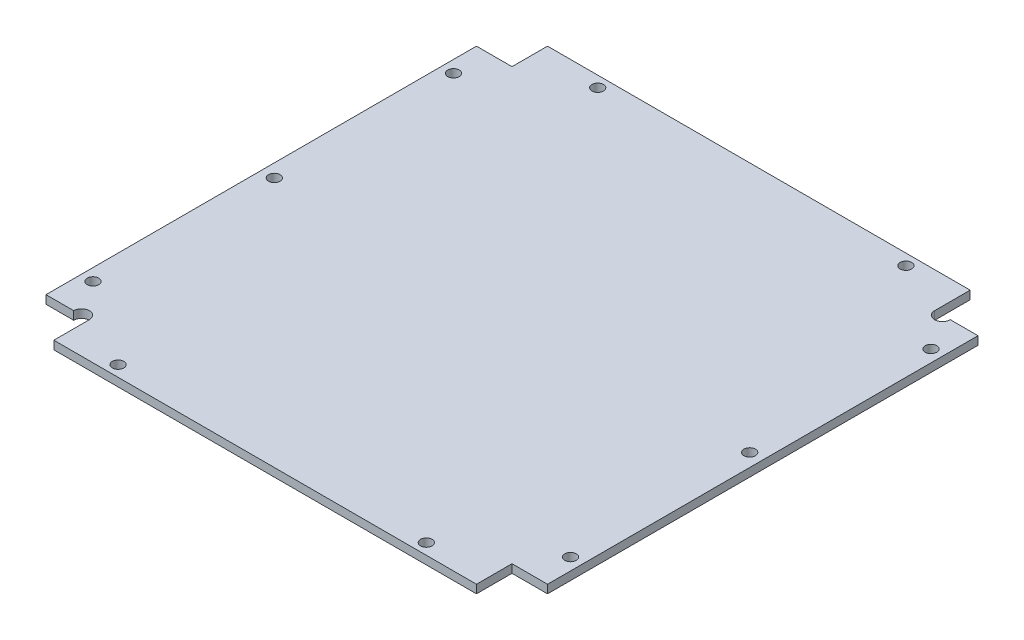
ISO-10303-21;
HEADER;
FILE_DESCRIPTION(('STEP AP214'),'2;1');
FILE_NAME('part.step','',(''),(''),'','','');
FILE_SCHEMA(('AUTOMOTIVE_DESIGN { 1 0 10303 214 1 1 1 1 }'));
ENDSEC;
DATA;
#1=APPLICATION_CONTEXT('core data for automotive mechanical design processes');
#2=APPLICATION_PROTOCOL_DEFINITION('international standard','automotive_design',2000,#1);
#3=PRODUCT_CONTEXT('',#1,'mechanical');
#4=PRODUCT('Part','Part','',(#3));
#5=PRODUCT_RELATED_PRODUCT_CATEGORY('part','',(#4));
#6=PRODUCT_DEFINITION_FORMATION('','',#4);
#7=PRODUCT_DEFINITION_CONTEXT('part definition',#1,'design');
#8=PRODUCT_DEFINITION('design','',#6,#7);
#9=PRODUCT_DEFINITION_SHAPE('','',#8);
#10=(LENGTH_UNIT() NAMED_UNIT(*) SI_UNIT(.MILLI.,.METRE.));
#11=(NAMED_UNIT(*) PLANE_ANGLE_UNIT() SI_UNIT($,.RADIAN.));
#12=(NAMED_UNIT(*) SI_UNIT($,.STERADIAN.) SOLID_ANGLE_UNIT());
#13=UNCERTAINTY_MEASURE_WITH_UNIT(LENGTH_MEASURE(1.E-05),#10,'distance_accuracy_value','');
#14=(GEOMETRIC_REPRESENTATION_CONTEXT(3) GLOBAL_UNCERTAINTY_ASSIGNED_CONTEXT((#13)) GLOBAL_UNIT_ASSIGNED_CONTEXT((#10,
#11,#12)) REPRESENTATION_CONTEXT('',''));
#15=CARTESIAN_POINT('',(0.,0.,0.));
#16=DIRECTION('',(0.,0.,1.));
#17=DIRECTION('',(1.,0.,0.));
#18=AXIS2_PLACEMENT_3D('',#15,#16,#17);
#19=CARTESIAN_POINT('',(0.,0.,0.));
#20=DIRECTION('',(0.,-1.,0.));
#21=DIRECTION('',(0.,0.,-1.));
#22=AXIS2_PLACEMENT_3D('',#19,#20,#21);
#23=PLANE('',#22);
#24=CARTESIAN_POINT('',(-33.3443844543068,0.,-2.20707499151679));
#25=DIRECTION('',(0.,1.,0.));
#26=DIRECTION('',(0.,0.,1.));
#27=AXIS2_PLACEMENT_3D('',#24,#25,#26);
#28=CIRCLE('',#27,1.1);
#29=CARTESIAN_POINT('',(-33.3443844543068,0.,-1.10707499151679));
#30=VERTEX_POINT('',#29);
#31=EDGE_CURVE('E439',#30,#30,#28,.T.);
#32=ORIENTED_EDGE('',*,*,#31,.T.);
#33=EDGE_LOOP('',(#32));
#34=FACE_BOUND('',#33,.T.);
#35=CARTESIAN_POINT('',(58.0556155456932,0.,-2.20707499151679));
#36=DIRECTION('',(0.,1.,0.));
#37=DIRECTION('',(0.,0.,1.));
#38=AXIS2_PLACEMENT_3D('',#35,#36,#37);
#39=CIRCLE('',#38,1.1);
#40=CARTESIAN_POINT('',(58.0556155456932,0.,-1.10707499151679));
#41=VERTEX_POINT('',#40);
#42=EDGE_CURVE('E290',#41,#41,#39,.T.);
#43=ORIENTED_EDGE('',*,*,#42,.T.);
#44=EDGE_LOOP('',(#43));
#45=FACE_BOUND('',#44,.T.);
#46=CARTESIAN_POINT('',(-28.8443844543068,0.,73.4929250084832));
#47=DIRECTION('',(0.,1.,0.));
#48=DIRECTION('',(0.,0.,1.));
#49=AXIS2_PLACEMENT_3D('',#46,#47,#48);
#50=CIRCLE('',#49,1.5);
#51=CARTESIAN_POINT('',(-27.3443844543068,0.,73.4929250084832));
#52=VERTEX_POINT('',#51);
#53=CARTESIAN_POINT('',(-30.3443844543068,0.,73.4929250084832));
#54=VERTEX_POINT('',#53);
#55=EDGE_CURVE('E132',#52,#54,#50,.T.);
#56=ORIENTED_EDGE('',*,*,#55,.T.);
#57=DIRECTION('',(-1.,0.,0.));
#58=VECTOR('',#57,1.);
#59=CARTESIAN_POINT('',(-27.3443844543068,0.,73.4929250084832));
#60=LINE('',#59,#58);
#61=CARTESIAN_POINT('',(-35.6443844543068,0.,73.4929250084832));
#62=VERTEX_POINT('',#61);
#63=EDGE_CURVE('E224',#54,#62,#60,.T.);
#64=ORIENTED_EDGE('',*,*,#63,.T.);
#65=DIRECTION('',(0.,0.,-1.));
#66=VECTOR('',#65,1.);
#67=CARTESIAN_POINT('',(-35.6443844543068,0.,73.4929250084832));
#68=LINE('',#67,#66);
#69=CARTESIAN_POINT('',(-35.6443844543068,0.,-8.90707499151679));
#70=VERTEX_POINT('',#69);
#71=EDGE_CURVE('E256',#62,#70,#68,.T.);
#72=ORIENTED_EDGE('',*,*,#71,.T.);
#73=DIRECTION('',(1.,0.,0.));
#74=VECTOR('',#73,1.);
#75=CARTESIAN_POINT('',(-35.6443844543068,0.,-8.90707499151679));
#76=LINE('',#75,#74);
#77=CARTESIAN_POINT('',(-28.8443844543068,0.,-8.90707499151679));
#78=VERTEX_POINT('',#77);
#79=EDGE_CURVE('E259',#70,#78,#76,.T.);
#80=ORIENTED_EDGE('',*,*,#79,.T.);
#81=DIRECTION('',(0.,0.,-1.));
#82=VECTOR('',#81,1.);
#83=CARTESIAN_POINT('',(-28.8443844543068,0.,-8.90707499151679));
#84=LINE('',#83,#82);
#85=CARTESIAN_POINT('',(-28.8443844543068,0.,-15.7070749915168));
#86=VERTEX_POINT('',#85);
#87=EDGE_CURVE('E262',#78,#86,#84,.T.);
#88=ORIENTED_EDGE('',*,*,#87,.T.);
#89=DIRECTION('',(1.,0.,0.));
#90=VECTOR('',#89,1.);
#91=CARTESIAN_POINT('',(-28.8443844543068,0.,-15.7070749915168));
#92=LINE('',#91,#90);
#93=CARTESIAN_POINT('',(52.0556155456932,0.,-15.7070749915168));
#94=VERTEX_POINT('',#93);
#95=EDGE_CURVE('E265',#86,#94,#92,.T.);
#96=ORIENTED_EDGE('',*,*,#95,.T.);
#97=DIRECTION('',(0.,0.,1.));
#98=VECTOR('',#97,1.);
#99=CARTESIAN_POINT('',(52.0556155456932,0.,-15.7070749915168));
#100=LINE('',#99,#98);
#101=CARTESIAN_POINT('',(52.0556155456932,0.,-8.90707499151679));
#102=VERTEX_POINT('',#101);
#103=EDGE_CURVE('E268',#94,#102,#100,.T.);
#104=ORIENTED_EDGE('',*,*,#103,.T.);
#105=CARTESIAN_POINT('',(53.5556155456932,0.,-8.90707499151679));
#106=DIRECTION('',(0.,-1.,0.));
#107=DIRECTION('',(0.,0.,-1.));
#108=AXIS2_PLACEMENT_3D('',#105,#106,#107);
#109=CIRCLE('',#108,1.5);
#110=CARTESIAN_POINT('',(55.0556155456932,0.,-8.90707499151679));
#111=VERTEX_POINT('',#110);
#112=EDGE_CURVE('E11',#111,#102,#109,.T.);
#113=ORIENTED_EDGE('',*,*,#112,.F.);
#114=DIRECTION('',(1.,0.,0.));
#115=VECTOR('',#114,1.);
#116=CARTESIAN_POINT('',(52.0556155456932,0.,-8.90707499151679));
#117=LINE('',#116,#115);
#118=CARTESIAN_POINT('',(60.3556155456932,0.,-8.90707499151679));
#119=VERTEX_POINT('',#118);
#120=EDGE_CURVE('E271',#111,#119,#117,.T.);
#121=ORIENTED_EDGE('',*,*,#120,.T.);
#122=DIRECTION('',(0.,0.,1.));
#123=VECTOR('',#122,1.);
#124=CARTESIAN_POINT('',(60.3556155456932,0.,-8.90707499151679));
#125=LINE('',#124,#123);
#126=CARTESIAN_POINT('',(60.3556155456932,0.,73.4929250084832));
#127=VERTEX_POINT('',#126);
#128=EDGE_CURVE('E273',#119,#127,#125,.T.);
#129=ORIENTED_EDGE('',*,*,#128,.T.);
#130=DIRECTION('',(-1.,0.,0.));
#131=VECTOR('',#130,1.);
#132=CARTESIAN_POINT('',(60.3556155456932,0.,73.4929250084832));
#133=LINE('',#132,#131);
#134=CARTESIAN_POINT('',(53.5556155456932,0.,73.4929250084832));
#135=VERTEX_POINT('',#134);
#136=EDGE_CURVE('E276',#127,#135,#133,.T.);
#137=ORIENTED_EDGE('',*,*,#136,.T.);
#138=DIRECTION('',(0.,0.,1.));
#139=VECTOR('',#138,1.);
#140=CARTESIAN_POINT('',(53.5556155456932,0.,73.4929250084832));
#141=LINE('',#140,#139);
#142=CARTESIAN_POINT('',(53.5556155456932,0.,80.2929250084832));
#143=VERTEX_POINT('',#142);
#144=EDGE_CURVE('E159',#135,#143,#141,.T.);
#145=ORIENTED_EDGE('',*,*,#144,.T.);
#146=DIRECTION('',(-1.,0.,0.));
#147=VECTOR('',#146,1.);
#148=CARTESIAN_POINT('',(53.5556155456932,0.,80.2929250084832));
#149=LINE('',#148,#147);
#150=CARTESIAN_POINT('',(-27.3443844543068,0.,80.2929250084832));
#151=VERTEX_POINT('',#150);
#152=EDGE_CURVE('E154',#143,#151,#149,.T.);
#153=ORIENTED_EDGE('',*,*,#152,.T.);
#154=DIRECTION('',(0.,0.,-1.));
#155=VECTOR('',#154,1.);
#156=CARTESIAN_POINT('',(-27.3443844543068,0.,80.2929250084832));
#157=LINE('',#156,#155);
#158=EDGE_CURVE('E145',#151,#52,#157,.T.);
#159=ORIENTED_EDGE('',*,*,#158,.T.);
#160=EDGE_LOOP('',(#56,#64,#72,#80,#88,#96,#104,#113,#121,#129,#137,#145,#153,#159));
#161=FACE_BOUND('',#160,.T.);
#162=CARTESIAN_POINT('',(57.8556155456932,0.,32.2929250084832));
#163=DIRECTION('',(0.,-1.,0.));
#164=DIRECTION('',(0.,0.,-1.));
#165=AXIS2_PLACEMENT_3D('',#162,#163,#164);
#166=CIRCLE('',#165,1.1);
#167=CARTESIAN_POINT('',(57.8556155456932,0.,31.1929250084832));
#168=VERTEX_POINT('',#167);
#169=EDGE_CURVE('E204',#168,#168,#166,.T.);
#170=ORIENTED_EDGE('',*,*,#169,.F.);
#171=EDGE_LOOP('',(#170));
#172=FACE_BOUND('',#171,.T.);
#173=CARTESIAN_POINT('',(-33.1443844543068,0.,32.2929250084832));
#174=DIRECTION('',(0.,-1.,0.));
#175=DIRECTION('',(0.,0.,-1.));
#176=AXIS2_PLACEMENT_3D('',#173,#174,#175);
#177=CIRCLE('',#176,1.1);
#178=CARTESIAN_POINT('',(-33.1443844543068,0.,31.1929250084832));
#179=VERTEX_POINT('',#178);
#180=EDGE_CURVE('E196',#179,#179,#177,.T.);
#181=ORIENTED_EDGE('',*,*,#180,.F.);
#182=EDGE_LOOP('',(#181));
#183=FACE_BOUND('',#182,.T.);
#184=CARTESIAN_POINT('',(41.8556155456932,0.,78.1929250084832));
#185=DIRECTION('',(0.,-1.,0.));
#186=DIRECTION('',(0.,0.,-1.));
#187=AXIS2_PLACEMENT_3D('',#184,#185,#186);
#188=CIRCLE('',#187,1.1);
#189=CARTESIAN_POINT('',(41.8556155456932,0.,77.0929250084832));
#190=VERTEX_POINT('',#189);
#191=EDGE_CURVE('E192',#190,#190,#188,.T.);
#192=ORIENTED_EDGE('',*,*,#191,.F.);
#193=EDGE_LOOP('',(#192));
#194=FACE_BOUND('',#193,.T.);
#195=CARTESIAN_POINT('',(41.8556155456932,0.,-13.6070749915168));
#196=DIRECTION('',(0.,-1.,0.));
#197=DIRECTION('',(0.,0.,-1.));
#198=AXIS2_PLACEMENT_3D('',#195,#196,#197);
#199=CIRCLE('',#198,1.1);
#200=CARTESIAN_POINT('',(41.8556155456932,0.,-14.7070749915168));
#201=VERTEX_POINT('',#200);
#202=EDGE_CURVE('E215',#201,#201,#199,.T.);
#203=ORIENTED_EDGE('',*,*,#202,.F.);
#204=EDGE_LOOP('',(#203));
#205=FACE_BOUND('',#204,.T.);
#206=CARTESIAN_POINT('',(-17.1443844543068,0.,-13.6070749915168));
#207=DIRECTION('',(0.,-1.,0.));
#208=DIRECTION('',(0.,0.,-1.));
#209=AXIS2_PLACEMENT_3D('',#206,#207,#208);
#210=CIRCLE('',#209,1.1);
#211=CARTESIAN_POINT('',(-17.1443844543068,0.,-14.7070749915168));
#212=VERTEX_POINT('',#211);
#213=EDGE_CURVE('E187',#212,#212,#210,.T.);
#214=ORIENTED_EDGE('',*,*,#213,.F.);
#215=EDGE_LOOP('',(#214));
#216=FACE_BOUND('',#215,.T.);
#217=CARTESIAN_POINT('',(-17.1443844543068,0.,78.1929250084832));
#218=DIRECTION('',(0.,-1.,0.));
#219=DIRECTION('',(0.,0.,-1.));
#220=AXIS2_PLACEMENT_3D('',#217,#218,#219);
#221=CIRCLE('',#220,1.1);
#222=CARTESIAN_POINT('',(-17.1443844543068,0.,77.0929250084832));
#223=VERTEX_POINT('',#222);
#224=EDGE_CURVE('E222',#223,#223,#221,.T.);
#225=ORIENTED_EDGE('',*,*,#224,.F.);
#226=EDGE_LOOP('',(#225));
#227=FACE_BOUND('',#226,.T.);
#228=CARTESIAN_POINT('',(58.0556155456932,0.,66.7929250084832));
#229=DIRECTION('',(0.,1.,0.));
#230=DIRECTION('',(0.,0.,1.));
#231=AXIS2_PLACEMENT_3D('',#228,#229,#230);
#232=CIRCLE('',#231,1.1);
#233=CARTESIAN_POINT('',(58.0556155456932,0.,67.8929250084832));
#234=VERTEX_POINT('',#233);
#235=EDGE_CURVE('E428',#234,#234,#232,.T.);
#236=ORIENTED_EDGE('',*,*,#235,.T.);
#237=EDGE_LOOP('',(#236));
#238=FACE_BOUND('',#237,.T.);
#239=CARTESIAN_POINT('',(-33.3443844543068,0.,66.7929250084832));
#240=DIRECTION('',(0.,1.,0.));
#241=DIRECTION('',(0.,0.,1.));
#242=AXIS2_PLACEMENT_3D('',#239,#240,#241);
#243=CIRCLE('',#242,1.1);
#244=CARTESIAN_POINT('',(-33.3443844543068,0.,67.8929250084832));
#245=VERTEX_POINT('',#244);
#246=EDGE_CURVE('E431',#245,#245,#243,.T.);
#247=ORIENTED_EDGE('',*,*,#246,.T.);
#248=EDGE_LOOP('',(#247));
#249=FACE_BOUND('',#248,.T.);
#250=ADVANCED_FACE('F35',(#34,#45,#161,#172,#183,#194,#205,#216,#227,#238,#249),#23,.T.);
#251=CARTESIAN_POINT('',(-27.3443844543068,1.6,73.4929250084832));
#252=DIRECTION('',(0.,0.,1.));
#253=DIRECTION('',(1.,0.,0.));
#254=AXIS2_PLACEMENT_3D('',#251,#252,#253);
#255=PLANE('',#254);
#256=DIRECTION('',(0.,1.,0.));
#257=VECTOR('',#256,1.);
#258=CARTESIAN_POINT('',(-30.3443844543068,0.,73.4929250084832));
#259=LINE('',#258,#257);
#260=CARTESIAN_POINT('',(-30.3443844543068,1.6,73.4929250084832));
#261=VERTEX_POINT('',#260);
#262=EDGE_CURVE('E50',#261,#54,#259,.F.);
#263=ORIENTED_EDGE('',*,*,#262,.F.);
#264=DIRECTION('',(-1.,0.,0.));
#265=VECTOR('',#264,1.);
#266=CARTESIAN_POINT('',(-27.3443844543068,1.6,73.4929250084832));
#267=LINE('',#266,#265);
#268=CARTESIAN_POINT('',(-35.6443844543068,1.6,73.4929250084832));
#269=VERTEX_POINT('',#268);
#270=EDGE_CURVE('E155',#261,#269,#267,.T.);
#271=ORIENTED_EDGE('',*,*,#270,.T.);
#272=DIRECTION('',(0.,-1.,0.));
#273=VECTOR('',#272,1.);
#274=CARTESIAN_POINT('',(-35.6443844543068,1.6,73.4929250084832));
#275=LINE('',#274,#273);
#276=EDGE_CURVE('E184',#269,#62,#275,.T.);
#277=ORIENTED_EDGE('',*,*,#276,.T.);
#278=ORIENTED_EDGE('',*,*,#63,.F.);
#279=EDGE_LOOP('',(#263,#271,#277,#278));
#280=FACE_BOUND('',#279,.T.);
#281=ADVANCED_FACE('F37',(#280),#255,.T.);
#282=CARTESIAN_POINT('',(-27.3443844543068,1.6,80.2929250084832));
#283=DIRECTION('',(-1.,0.,0.));
#284=DIRECTION('',(0.,0.,1.));
#285=AXIS2_PLACEMENT_3D('',#282,#283,#284);
#286=PLANE('',#285);
#287=ORIENTED_EDGE('',*,*,#158,.F.);
#288=DIRECTION('',(0.,-1.,0.));
#289=VECTOR('',#288,1.);
#290=CARTESIAN_POINT('',(-27.3443844543068,1.6,80.2929250084832));
#291=LINE('',#290,#289);
#292=CARTESIAN_POINT('',(-27.3443844543068,1.6,80.2929250084832));
#293=VERTEX_POINT('',#292);
#294=EDGE_CURVE('E148',#293,#151,#291,.T.);
#295=ORIENTED_EDGE('',*,*,#294,.F.);
#296=DIRECTION('',(0.,0.,-1.));
#297=VECTOR('',#296,1.);
#298=CARTESIAN_POINT('',(-27.3443844543068,1.6,80.2929250084832));
#299=LINE('',#298,#297);
#300=CARTESIAN_POINT('',(-27.3443844543068,1.6,73.4929250084832));
#301=VERTEX_POINT('',#300);
#302=EDGE_CURVE('E147',#293,#301,#299,.T.);
#303=ORIENTED_EDGE('',*,*,#302,.T.);
#304=DIRECTION('',(0.,-1.,0.));
#305=VECTOR('',#304,1.);
#306=CARTESIAN_POINT('',(-27.3443844543068,1.6,73.4929250084832));
#307=LINE('',#306,#305);
#308=EDGE_CURVE('E43',#301,#52,#307,.T.);
#309=ORIENTED_EDGE('',*,*,#308,.T.);
#310=EDGE_LOOP('',(#287,#295,#303,#309));
#311=FACE_BOUND('',#310,.T.);
#312=ADVANCED_FACE('F144',(#311),#286,.T.);
#313=CARTESIAN_POINT('',(53.5556155456932,1.6,80.2929250084832));
#314=DIRECTION('',(0.,0.,1.));
#315=DIRECTION('',(1.,0.,0.));
#316=AXIS2_PLACEMENT_3D('',#313,#314,#315);
#317=PLANE('',#316);
#318=ORIENTED_EDGE('',*,*,#152,.F.);
#319=DIRECTION('',(0.,-1.,0.));
#320=VECTOR('',#319,1.);
#321=CARTESIAN_POINT('',(53.5556155456932,1.6,80.2929250084832));
#322=LINE('',#321,#320);
#323=CARTESIAN_POINT('',(53.5556155456932,1.6,80.2929250084832));
#324=VERTEX_POINT('',#323);
#325=EDGE_CURVE('E164',#324,#143,#322,.T.);
#326=ORIENTED_EDGE('',*,*,#325,.F.);
#327=DIRECTION('',(-1.,0.,0.));
#328=VECTOR('',#327,1.);
#329=CARTESIAN_POINT('',(53.5556155456932,1.6,80.2929250084832));
#330=LINE('',#329,#328);
#331=EDGE_CURVE('E251',#324,#293,#330,.T.);
#332=ORIENTED_EDGE('',*,*,#331,.T.);
#333=ORIENTED_EDGE('',*,*,#294,.T.);
#334=EDGE_LOOP('',(#318,#326,#332,#333));
#335=FACE_BOUND('',#334,.T.);
#336=ADVANCED_FACE('F285',(#335),#317,.T.);
#337=CARTESIAN_POINT('',(53.5556155456932,1.6,73.4929250084832));
#338=DIRECTION('',(1.,0.,0.));
#339=DIRECTION('',(0.,0.,-1.));
#340=AXIS2_PLACEMENT_3D('',#337,#338,#339);
#341=PLANE('',#340);
#342=ORIENTED_EDGE('',*,*,#144,.F.);
#343=DIRECTION('',(0.,-1.,0.));
#344=VECTOR('',#343,1.);
#345=CARTESIAN_POINT('',(53.5556155456932,1.6,73.4929250084832));
#346=LINE('',#345,#344);
#347=CARTESIAN_POINT('',(53.5556155456932,1.6,73.4929250084832));
#348=VERTEX_POINT('',#347);
#349=EDGE_CURVE('E166',#348,#135,#346,.T.);
#350=ORIENTED_EDGE('',*,*,#349,.F.);
#351=DIRECTION('',(0.,0.,1.));
#352=VECTOR('',#351,1.);
#353=CARTESIAN_POINT('',(53.5556155456932,1.6,73.4929250084832));
#354=LINE('',#353,#352);
#355=EDGE_CURVE('E248',#348,#324,#354,.T.);
#356=ORIENTED_EDGE('',*,*,#355,.T.);
#357=ORIENTED_EDGE('',*,*,#325,.T.);
#358=EDGE_LOOP('',(#342,#350,#356,#357));
#359=FACE_BOUND('',#358,.T.);
#360=ADVANCED_FACE('F281',(#359),#341,.T.);
#361=CARTESIAN_POINT('',(60.3556155456932,1.6,73.4929250084832));
#362=DIRECTION('',(0.,0.,1.));
#363=DIRECTION('',(1.,0.,0.));
#364=AXIS2_PLACEMENT_3D('',#361,#362,#363);
#365=PLANE('',#364);
#366=ORIENTED_EDGE('',*,*,#136,.F.);
#367=DIRECTION('',(0.,-1.,0.));
#368=VECTOR('',#367,1.);
#369=CARTESIAN_POINT('',(60.3556155456932,1.6,73.4929250084832));
#370=LINE('',#369,#368);
#371=CARTESIAN_POINT('',(60.3556155456932,1.6,73.4929250084832));
#372=VERTEX_POINT('',#371);
#373=EDGE_CURVE('E168',#372,#127,#370,.T.);
#374=ORIENTED_EDGE('',*,*,#373,.F.);
#375=DIRECTION('',(-1.,0.,0.));
#376=VECTOR('',#375,1.);
#377=CARTESIAN_POINT('',(60.3556155456932,1.6,73.4929250084832));
#378=LINE('',#377,#376);
#379=EDGE_CURVE('E245',#372,#348,#378,.T.);
#380=ORIENTED_EDGE('',*,*,#379,.T.);
#381=ORIENTED_EDGE('',*,*,#349,.T.);
#382=EDGE_LOOP('',(#366,#374,#380,#381));
#383=FACE_BOUND('',#382,.T.);
#384=ADVANCED_FACE('F345',(#383),#365,.T.);
#385=CARTESIAN_POINT('',(60.3556155456932,1.6,-8.90707499151679));
#386=DIRECTION('',(1.,0.,0.));
#387=DIRECTION('',(0.,0.,-1.));
#388=AXIS2_PLACEMENT_3D('',#385,#386,#387);
#389=PLANE('',#388);
#390=ORIENTED_EDGE('',*,*,#128,.F.);
#391=DIRECTION('',(0.,-1.,0.));
#392=VECTOR('',#391,1.);
#393=CARTESIAN_POINT('',(60.3556155456932,1.6,-8.90707499151679));
#394=LINE('',#393,#392);
#395=CARTESIAN_POINT('',(60.3556155456932,1.6,-8.90707499151679));
#396=VERTEX_POINT('',#395);
#397=EDGE_CURVE('E170',#396,#119,#394,.T.);
#398=ORIENTED_EDGE('',*,*,#397,.F.);
#399=DIRECTION('',(0.,0.,1.));
#400=VECTOR('',#399,1.);
#401=CARTESIAN_POINT('',(60.3556155456932,1.6,-8.90707499151679));
#402=LINE('',#401,#400);
#403=EDGE_CURVE('E242',#396,#372,#402,.T.);
#404=ORIENTED_EDGE('',*,*,#403,.T.);
#405=ORIENTED_EDGE('',*,*,#373,.T.);
#406=EDGE_LOOP('',(#390,#398,#404,#405));
#407=FACE_BOUND('',#406,.T.);
#408=ADVANCED_FACE('F348',(#407),#389,.T.);
#409=CARTESIAN_POINT('',(52.0556155456932,1.6,-8.90707499151679));
#410=DIRECTION('',(0.,0.,-1.));
#411=DIRECTION('',(-1.,0.,0.));
#412=AXIS2_PLACEMENT_3D('',#409,#410,#411);
#413=PLANE('',#412);
#414=DIRECTION('',(0.,1.,0.));
#415=VECTOR('',#414,1.);
#416=CARTESIAN_POINT('',(55.0556155456932,0.,-8.90707499151679));
#417=LINE('',#416,#415);
#418=CARTESIAN_POINT('',(55.0556155456932,1.6,-8.90707499151679));
#419=VERTEX_POINT('',#418);
#420=EDGE_CURVE('E57',#419,#111,#417,.F.);
#421=ORIENTED_EDGE('',*,*,#420,.F.);
#422=DIRECTION('',(1.,0.,0.));
#423=VECTOR('',#422,1.);
#424=CARTESIAN_POINT('',(52.0556155456932,1.6,-8.90707499151679));
#425=LINE('',#424,#423);
#426=EDGE_CURVE('E240',#419,#396,#425,.T.);
#427=ORIENTED_EDGE('',*,*,#426,.T.);
#428=ORIENTED_EDGE('',*,*,#397,.T.);
#429=ORIENTED_EDGE('',*,*,#120,.F.);
#430=EDGE_LOOP('',(#421,#427,#428,#429));
#431=FACE_BOUND('',#430,.T.);
#432=ADVANCED_FACE('F352',(#431),#413,.T.);
#433=CARTESIAN_POINT('',(52.0556155456932,1.6,-15.7070749915168));
#434=DIRECTION('',(1.,0.,0.));
#435=DIRECTION('',(0.,0.,-1.));
#436=AXIS2_PLACEMENT_3D('',#433,#434,#435);
#437=PLANE('',#436);
#438=ORIENTED_EDGE('',*,*,#103,.F.);
#439=DIRECTION('',(0.,-1.,0.));
#440=VECTOR('',#439,1.);
#441=CARTESIAN_POINT('',(52.0556155456932,1.6,-15.7070749915168));
#442=LINE('',#441,#440);
#443=CARTESIAN_POINT('',(52.0556155456932,1.6,-15.7070749915168));
#444=VERTEX_POINT('',#443);
#445=EDGE_CURVE('E176',#444,#94,#442,.T.);
#446=ORIENTED_EDGE('',*,*,#445,.F.);
#447=DIRECTION('',(0.,0.,1.));
#448=VECTOR('',#447,1.);
#449=CARTESIAN_POINT('',(52.0556155456932,1.6,-15.7070749915168));
#450=LINE('',#449,#448);
#451=CARTESIAN_POINT('',(52.0556155456932,1.6,-8.90707499151679));
#452=VERTEX_POINT('',#451);
#453=EDGE_CURVE('E237',#444,#452,#450,.T.);
#454=ORIENTED_EDGE('',*,*,#453,.T.);
#455=DIRECTION('',(0.,-1.,0.));
#456=VECTOR('',#455,1.);
#457=CARTESIAN_POINT('',(52.0556155456932,1.6,-8.90707499151679));
#458=LINE('',#457,#456);
#459=EDGE_CURVE('E173',#452,#102,#458,.T.);
#460=ORIENTED_EDGE('',*,*,#459,.T.);
#461=EDGE_LOOP('',(#438,#446,#454,#460));
#462=FACE_BOUND('',#461,.T.);
#463=ADVANCED_FACE('F356',(#462),#437,.T.);
#464=CARTESIAN_POINT('',(-28.8443844543068,1.6,-15.7070749915168));
#465=DIRECTION('',(0.,0.,-1.));
#466=DIRECTION('',(-1.,0.,0.));
#467=AXIS2_PLACEMENT_3D('',#464,#465,#466);
#468=PLANE('',#467);
#469=ORIENTED_EDGE('',*,*,#95,.F.);
#470=DIRECTION('',(0.,-1.,0.));
#471=VECTOR('',#470,1.);
#472=CARTESIAN_POINT('',(-28.8443844543068,1.6,-15.7070749915168));
#473=LINE('',#472,#471);
#474=CARTESIAN_POINT('',(-28.8443844543068,1.6,-15.7070749915168));
#475=VERTEX_POINT('',#474);
#476=EDGE_CURVE('E178',#475,#86,#473,.T.);
#477=ORIENTED_EDGE('',*,*,#476,.F.);
#478=DIRECTION('',(1.,0.,0.));
#479=VECTOR('',#478,1.);
#480=CARTESIAN_POINT('',(-28.8443844543068,1.6,-15.7070749915168));
#481=LINE('',#480,#479);
#482=EDGE_CURVE('E234',#475,#444,#481,.T.);
#483=ORIENTED_EDGE('',*,*,#482,.T.);
#484=ORIENTED_EDGE('',*,*,#445,.T.);
#485=EDGE_LOOP('',(#469,#477,#483,#484));
#486=FACE_BOUND('',#485,.T.);
#487=ADVANCED_FACE('F360',(#486),#468,.T.);
#488=CARTESIAN_POINT('',(-28.8443844543068,1.6,-8.90707499151679));
#489=DIRECTION('',(-1.,0.,0.));
#490=DIRECTION('',(0.,0.,1.));
#491=AXIS2_PLACEMENT_3D('',#488,#489,#490);
#492=PLANE('',#491);
#493=ORIENTED_EDGE('',*,*,#87,.F.);
#494=DIRECTION('',(0.,-1.,0.));
#495=VECTOR('',#494,1.);
#496=CARTESIAN_POINT('',(-28.8443844543068,1.6,-8.90707499151679));
#497=LINE('',#496,#495);
#498=CARTESIAN_POINT('',(-28.8443844543068,1.6,-8.90707499151679));
#499=VERTEX_POINT('',#498);
#500=EDGE_CURVE('E180',#499,#78,#497,.T.);
#501=ORIENTED_EDGE('',*,*,#500,.F.);
#502=DIRECTION('',(0.,0.,-1.));
#503=VECTOR('',#502,1.);
#504=CARTESIAN_POINT('',(-28.8443844543068,1.6,-8.90707499151679));
#505=LINE('',#504,#503);
#506=EDGE_CURVE('E231',#499,#475,#505,.T.);
#507=ORIENTED_EDGE('',*,*,#506,.T.);
#508=ORIENTED_EDGE('',*,*,#476,.T.);
#509=EDGE_LOOP('',(#493,#501,#507,#508));
#510=FACE_BOUND('',#509,.T.);
#511=ADVANCED_FACE('F364',(#510),#492,.T.);
#512=CARTESIAN_POINT('',(-35.6443844543068,1.6,-8.90707499151679));
#513=DIRECTION('',(0.,0.,-1.));
#514=DIRECTION('',(-1.,0.,0.));
#515=AXIS2_PLACEMENT_3D('',#512,#513,#514);
#516=PLANE('',#515);
#517=ORIENTED_EDGE('',*,*,#79,.F.);
#518=DIRECTION('',(0.,-1.,0.));
#519=VECTOR('',#518,1.);
#520=CARTESIAN_POINT('',(-35.6443844543068,1.6,-8.90707499151679));
#521=LINE('',#520,#519);
#522=CARTESIAN_POINT('',(-35.6443844543068,1.6,-8.90707499151679));
#523=VERTEX_POINT('',#522);
#524=EDGE_CURVE('E182',#523,#70,#521,.T.);
#525=ORIENTED_EDGE('',*,*,#524,.F.);
#526=DIRECTION('',(1.,0.,0.));
#527=VECTOR('',#526,1.);
#528=CARTESIAN_POINT('',(-35.6443844543068,1.6,-8.90707499151679));
#529=LINE('',#528,#527);
#530=EDGE_CURVE('E228',#523,#499,#529,.T.);
#531=ORIENTED_EDGE('',*,*,#530,.T.);
#532=ORIENTED_EDGE('',*,*,#500,.T.);
#533=EDGE_LOOP('',(#517,#525,#531,#532));
#534=FACE_BOUND('',#533,.T.);
#535=ADVANCED_FACE('F368',(#534),#516,.T.);
#536=CARTESIAN_POINT('',(-35.6443844543068,1.6,73.4929250084832));
#537=DIRECTION('',(-1.,0.,0.));
#538=DIRECTION('',(0.,0.,1.));
#539=AXIS2_PLACEMENT_3D('',#536,#537,#538);
#540=PLANE('',#539);
#541=ORIENTED_EDGE('',*,*,#71,.F.);
#542=ORIENTED_EDGE('',*,*,#276,.F.);
#543=DIRECTION('',(0.,0.,-1.));
#544=VECTOR('',#543,1.);
#545=CARTESIAN_POINT('',(-35.6443844543068,1.6,73.4929250084832));
#546=LINE('',#545,#544);
#547=EDGE_CURVE('E157',#269,#523,#546,.T.);
#548=ORIENTED_EDGE('',*,*,#547,.T.);
#549=ORIENTED_EDGE('',*,*,#524,.T.);
#550=EDGE_LOOP('',(#541,#542,#548,#549));
#551=FACE_BOUND('',#550,.T.);
#552=ADVANCED_FACE('F307',(#551),#540,.T.);
#553=CARTESIAN_POINT('',(0.,1.6,0.));
#554=DIRECTION('',(0.,-1.,0.));
#555=DIRECTION('',(0.,0.,-1.));
#556=AXIS2_PLACEMENT_3D('',#553,#554,#555);
#557=PLANE('',#556);
#558=CARTESIAN_POINT('',(-33.3443844543068,1.6,-2.20707499151679));
#559=DIRECTION('',(0.,1.,0.));
#560=DIRECTION('',(0.,0.,1.));
#561=AXIS2_PLACEMENT_3D('',#558,#559,#560);
#562=CIRCLE('',#561,1.1);
#563=CARTESIAN_POINT('',(-33.3443844543068,1.6,-1.10707499151679));
#564=VERTEX_POINT('',#563);
#565=EDGE_CURVE('E470',#564,#564,#562,.T.);
#566=ORIENTED_EDGE('',*,*,#565,.F.);
#567=EDGE_LOOP('',(#566));
#568=FACE_BOUND('',#567,.T.);
#569=CARTESIAN_POINT('',(-33.3443844543068,1.6,66.7929250084832));
#570=DIRECTION('',(0.,1.,0.));
#571=DIRECTION('',(0.,0.,1.));
#572=AXIS2_PLACEMENT_3D('',#569,#570,#571);
#573=CIRCLE('',#572,1.1);
#574=CARTESIAN_POINT('',(-33.3443844543068,1.6,67.8929250084832));
#575=VERTEX_POINT('',#574);
#576=EDGE_CURVE('E434',#575,#575,#573,.T.);
#577=ORIENTED_EDGE('',*,*,#576,.F.);
#578=EDGE_LOOP('',(#577));
#579=FACE_BOUND('',#578,.T.);
#580=CARTESIAN_POINT('',(58.0556155456932,1.6,66.7929250084832));
#581=DIRECTION('',(0.,1.,0.));
#582=DIRECTION('',(0.,0.,1.));
#583=AXIS2_PLACEMENT_3D('',#580,#581,#582);
#584=CIRCLE('',#583,1.1);
#585=CARTESIAN_POINT('',(58.0556155456932,1.6,67.8929250084832));
#586=VERTEX_POINT('',#585);
#587=EDGE_CURVE('E433',#586,#586,#584,.T.);
#588=ORIENTED_EDGE('',*,*,#587,.F.);
#589=EDGE_LOOP('',(#588));
#590=FACE_BOUND('',#589,.T.);
#591=CARTESIAN_POINT('',(58.0556155456932,1.6,-2.20707499151679));
#592=DIRECTION('',(0.,1.,0.));
#593=DIRECTION('',(0.,0.,1.));
#594=AXIS2_PLACEMENT_3D('',#591,#592,#593);
#595=CIRCLE('',#594,1.1);
#596=CARTESIAN_POINT('',(58.0556155456932,1.6,-1.10707499151679));
#597=VERTEX_POINT('',#596);
#598=EDGE_CURVE('E293',#597,#597,#595,.T.);
#599=ORIENTED_EDGE('',*,*,#598,.F.);
#600=EDGE_LOOP('',(#599));
#601=FACE_BOUND('',#600,.T.);
#602=CARTESIAN_POINT('',(57.8556155456932,1.6,32.2929250084832));
#603=DIRECTION('',(0.,1.,0.));
#604=DIRECTION('',(0.,0.,1.));
#605=AXIS2_PLACEMENT_3D('',#602,#603,#604);
#606=CIRCLE('',#605,1.1);
#607=CARTESIAN_POINT('',(57.8556155456932,1.6,33.3929250084832));
#608=VERTEX_POINT('',#607);
#609=EDGE_CURVE('E209',#608,#608,#606,.T.);
#610=ORIENTED_EDGE('',*,*,#609,.F.);
#611=EDGE_LOOP('',(#610));
#612=FACE_BOUND('',#611,.T.);
#613=CARTESIAN_POINT('',(-33.1443844543068,1.6,32.2929250084832));
#614=DIRECTION('',(0.,1.,0.));
#615=DIRECTION('',(0.,0.,1.));
#616=AXIS2_PLACEMENT_3D('',#613,#614,#615);
#617=CIRCLE('',#616,1.1);
#618=CARTESIAN_POINT('',(-33.1443844543068,1.6,33.3929250084832));
#619=VERTEX_POINT('',#618);
#620=EDGE_CURVE('E198',#619,#619,#617,.T.);
#621=ORIENTED_EDGE('',*,*,#620,.F.);
#622=EDGE_LOOP('',(#621));
#623=FACE_BOUND('',#622,.T.);
#624=CARTESIAN_POINT('',(41.8556155456932,1.6,78.1929250084832));
#625=DIRECTION('',(0.,1.,0.));
#626=DIRECTION('',(0.,0.,1.));
#627=AXIS2_PLACEMENT_3D('',#624,#625,#626);
#628=CIRCLE('',#627,1.1);
#629=CARTESIAN_POINT('',(41.8556155456932,1.6,79.2929250084832));
#630=VERTEX_POINT('',#629);
#631=EDGE_CURVE('E195',#630,#630,#628,.T.);
#632=ORIENTED_EDGE('',*,*,#631,.F.);
#633=EDGE_LOOP('',(#632));
#634=FACE_BOUND('',#633,.T.);
#635=CARTESIAN_POINT('',(41.8556155456932,1.6,-13.6070749915168));
#636=DIRECTION('',(0.,1.,0.));
#637=DIRECTION('',(0.,0.,1.));
#638=AXIS2_PLACEMENT_3D('',#635,#636,#637);
#639=CIRCLE('',#638,1.1);
#640=CARTESIAN_POINT('',(41.8556155456932,1.6,-12.5070749915168));
#641=VERTEX_POINT('',#640);
#642=EDGE_CURVE('E194',#641,#641,#639,.T.);
#643=ORIENTED_EDGE('',*,*,#642,.F.);
#644=EDGE_LOOP('',(#643));
#645=FACE_BOUND('',#644,.T.);
#646=CARTESIAN_POINT('',(-17.1443844543068,1.6,-13.6070749915168));
#647=DIRECTION('',(0.,1.,0.));
#648=DIRECTION('',(0.,0.,1.));
#649=AXIS2_PLACEMENT_3D('',#646,#647,#648);
#650=CIRCLE('',#649,1.1);
#651=CARTESIAN_POINT('',(-17.1443844543068,1.6,-12.5070749915168));
#652=VERTEX_POINT('',#651);
#653=EDGE_CURVE('E191',#652,#652,#650,.T.);
#654=ORIENTED_EDGE('',*,*,#653,.F.);
#655=EDGE_LOOP('',(#654));
#656=FACE_BOUND('',#655,.T.);
#657=CARTESIAN_POINT('',(-17.1443844543068,1.6,78.1929250084832));
#658=DIRECTION('',(0.,1.,0.));
#659=DIRECTION('',(0.,0.,1.));
#660=AXIS2_PLACEMENT_3D('',#657,#658,#659);
#661=CIRCLE('',#660,1.1);
#662=CARTESIAN_POINT('',(-17.1443844543068,1.6,79.2929250084832));
#663=VERTEX_POINT('',#662);
#664=EDGE_CURVE('E190',#663,#663,#661,.T.);
#665=ORIENTED_EDGE('',*,*,#664,.F.);
#666=EDGE_LOOP('',(#665));
#667=FACE_BOUND('',#666,.T.);
#668=ORIENTED_EDGE('',*,*,#270,.F.);
#669=CARTESIAN_POINT('',(-28.8443844543068,1.6,73.4929250084832));
#670=DIRECTION('',(0.,1.,0.));
#671=DIRECTION('',(0.,0.,1.));
#672=AXIS2_PLACEMENT_3D('',#669,#670,#671);
#673=CIRCLE('',#672,1.5);
#674=EDGE_CURVE('E139',#301,#261,#673,.T.);
#675=ORIENTED_EDGE('',*,*,#674,.F.);
#676=ORIENTED_EDGE('',*,*,#302,.F.);
#677=ORIENTED_EDGE('',*,*,#331,.F.);
#678=ORIENTED_EDGE('',*,*,#355,.F.);
#679=ORIENTED_EDGE('',*,*,#379,.F.);
#680=ORIENTED_EDGE('',*,*,#403,.F.);
#681=ORIENTED_EDGE('',*,*,#426,.F.);
#682=CARTESIAN_POINT('',(53.5556155456932,1.6,-8.90707499151679));
#683=DIRECTION('',(0.,1.,0.));
#684=DIRECTION('',(0.,0.,1.));
#685=AXIS2_PLACEMENT_3D('',#682,#683,#684);
#686=CIRCLE('',#685,1.5);
#687=EDGE_CURVE('E297',#452,#419,#686,.T.);
#688=ORIENTED_EDGE('',*,*,#687,.F.);
#689=ORIENTED_EDGE('',*,*,#453,.F.);
#690=ORIENTED_EDGE('',*,*,#482,.F.);
#691=ORIENTED_EDGE('',*,*,#506,.F.);
#692=ORIENTED_EDGE('',*,*,#530,.F.);
#693=ORIENTED_EDGE('',*,*,#547,.F.);
#694=EDGE_LOOP('',(#668,#675,#676,#677,#678,#679,#680,#681,#688,#689,#690,#691,#692,#693));
#695=FACE_BOUND('',#694,.T.);
#696=ADVANCED_FACE('F288',(#568,#579,#590,#601,#612,#623,#634,#645,#656,#667,#695),#557,.F.);
#697=CARTESIAN_POINT('',(-17.1443844543068,1.6,78.1929250084832));
#698=DIRECTION('',(0.,1.,0.));
#699=DIRECTION('',(0.,0.,1.));
#700=AXIS2_PLACEMENT_3D('',#697,#698,#699);
#701=CYLINDRICAL_SURFACE('',#700,1.1);
#702=ORIENTED_EDGE('',*,*,#224,.T.);
#703=EDGE_LOOP('',(#702));
#704=FACE_BOUND('',#703,.T.);
#705=ORIENTED_EDGE('',*,*,#664,.T.);
#706=EDGE_LOOP('',(#705));
#707=FACE_BOUND('',#706,.T.);
#708=ADVANCED_FACE('F306',(#704,#707),#701,.F.);
#709=CARTESIAN_POINT('',(-17.1443844543068,1.6,-13.6070749915168));
#710=DIRECTION('',(0.,1.,0.));
#711=DIRECTION('',(0.,0.,1.));
#712=AXIS2_PLACEMENT_3D('',#709,#710,#711);
#713=CYLINDRICAL_SURFACE('',#712,1.1);
#714=ORIENTED_EDGE('',*,*,#213,.T.);
#715=EDGE_LOOP('',(#714));
#716=FACE_BOUND('',#715,.T.);
#717=ORIENTED_EDGE('',*,*,#653,.T.);
#718=EDGE_LOOP('',(#717));
#719=FACE_BOUND('',#718,.T.);
#720=ADVANCED_FACE('F320',(#716,#719),#713,.F.);
#721=CARTESIAN_POINT('',(41.8556155456932,1.6,-13.6070749915168));
#722=DIRECTION('',(0.,1.,0.));
#723=DIRECTION('',(0.,0.,1.));
#724=AXIS2_PLACEMENT_3D('',#721,#722,#723);
#725=CYLINDRICAL_SURFACE('',#724,1.1);
#726=ORIENTED_EDGE('',*,*,#202,.T.);
#727=EDGE_LOOP('',(#726));
#728=FACE_BOUND('',#727,.T.);
#729=ORIENTED_EDGE('',*,*,#642,.T.);
#730=EDGE_LOOP('',(#729));
#731=FACE_BOUND('',#730,.T.);
#732=ADVANCED_FACE('F326',(#728,#731),#725,.F.);
#733=CARTESIAN_POINT('',(41.8556155456932,1.6,78.1929250084832));
#734=DIRECTION('',(0.,1.,0.));
#735=DIRECTION('',(0.,0.,1.));
#736=AXIS2_PLACEMENT_3D('',#733,#734,#735);
#737=CYLINDRICAL_SURFACE('',#736,1.1);
#738=ORIENTED_EDGE('',*,*,#191,.T.);
#739=EDGE_LOOP('',(#738));
#740=FACE_BOUND('',#739,.T.);
#741=ORIENTED_EDGE('',*,*,#631,.T.);
#742=EDGE_LOOP('',(#741));
#743=FACE_BOUND('',#742,.T.);
#744=ADVANCED_FACE('F409',(#740,#743),#737,.F.);
#745=CARTESIAN_POINT('',(-33.1443844543068,1.6,32.2929250084832));
#746=DIRECTION('',(0.,1.,0.));
#747=DIRECTION('',(0.,0.,1.));
#748=AXIS2_PLACEMENT_3D('',#745,#746,#747);
#749=CYLINDRICAL_SURFACE('',#748,1.1);
#750=ORIENTED_EDGE('',*,*,#180,.T.);
#751=EDGE_LOOP('',(#750));
#752=FACE_BOUND('',#751,.T.);
#753=ORIENTED_EDGE('',*,*,#620,.T.);
#754=EDGE_LOOP('',(#753));
#755=FACE_BOUND('',#754,.T.);
#756=ADVANCED_FACE('F402',(#752,#755),#749,.F.);
#757=CARTESIAN_POINT('',(57.8556155456932,1.6,32.2929250084832));
#758=DIRECTION('',(0.,1.,0.));
#759=DIRECTION('',(0.,0.,1.));
#760=AXIS2_PLACEMENT_3D('',#757,#758,#759);
#761=CYLINDRICAL_SURFACE('',#760,1.1);
#762=ORIENTED_EDGE('',*,*,#169,.T.);
#763=EDGE_LOOP('',(#762));
#764=FACE_BOUND('',#763,.T.);
#765=ORIENTED_EDGE('',*,*,#609,.T.);
#766=EDGE_LOOP('',(#765));
#767=FACE_BOUND('',#766,.T.);
#768=ADVANCED_FACE('F302',(#764,#767),#761,.F.);
#769=CARTESIAN_POINT('',(53.5556155456932,0.,-8.90707499151679));
#770=DIRECTION('',(0.,1.,0.));
#771=DIRECTION('',(0.,0.,1.));
#772=AXIS2_PLACEMENT_3D('',#769,#770,#771);
#773=CYLINDRICAL_SURFACE('',#772,1.5);
#774=ORIENTED_EDGE('',*,*,#420,.T.);
#775=ORIENTED_EDGE('',*,*,#112,.T.);
#776=ORIENTED_EDGE('',*,*,#459,.F.);
#777=ORIENTED_EDGE('',*,*,#687,.T.);
#778=EDGE_LOOP('',(#774,#775,#776,#777));
#779=FACE_BOUND('',#778,.T.);
#780=ADVANCED_FACE('F388',(#779),#773,.F.);
#781=CARTESIAN_POINT('',(-28.8443844543068,0.,73.4929250084832));
#782=DIRECTION('',(0.,1.,0.));
#783=DIRECTION('',(0.,0.,1.));
#784=AXIS2_PLACEMENT_3D('',#781,#782,#783);
#785=CYLINDRICAL_SURFACE('',#784,1.5);
#786=ORIENTED_EDGE('',*,*,#262,.T.);
#787=ORIENTED_EDGE('',*,*,#55,.F.);
#788=ORIENTED_EDGE('',*,*,#308,.F.);
#789=ORIENTED_EDGE('',*,*,#674,.T.);
#790=EDGE_LOOP('',(#786,#787,#788,#789));
#791=FACE_BOUND('',#790,.T.);
#792=ADVANCED_FACE('F134',(#791),#785,.F.);
#793=CARTESIAN_POINT('',(58.0556155456932,1.6,-2.20707499151679));
#794=DIRECTION('',(0.,1.,0.));
#795=DIRECTION('',(0.,0.,1.));
#796=AXIS2_PLACEMENT_3D('',#793,#794,#795);
#797=CYLINDRICAL_SURFACE('',#796,1.1);
#798=ORIENTED_EDGE('',*,*,#42,.F.);
#799=EDGE_LOOP('',(#798));
#800=FACE_BOUND('',#799,.T.);
#801=ORIENTED_EDGE('',*,*,#598,.T.);
#802=EDGE_LOOP('',(#801));
#803=FACE_BOUND('',#802,.T.);
#804=ADVANCED_FACE('F400',(#800,#803),#797,.F.);
#805=CARTESIAN_POINT('',(58.0556155456932,1.6,66.7929250084832));
#806=DIRECTION('',(0.,1.,0.));
#807=DIRECTION('',(0.,0.,1.));
#808=AXIS2_PLACEMENT_3D('',#805,#806,#807);
#809=CYLINDRICAL_SURFACE('',#808,1.1);
#810=ORIENTED_EDGE('',*,*,#235,.F.);
#811=EDGE_LOOP('',(#810));
#812=FACE_BOUND('',#811,.T.);
#813=ORIENTED_EDGE('',*,*,#587,.T.);
#814=EDGE_LOOP('',(#813));
#815=FACE_BOUND('',#814,.T.);
#816=ADVANCED_FACE('F449',(#812,#815),#809,.F.);
#817=CARTESIAN_POINT('',(-33.3443844543068,1.6,66.7929250084832));
#818=DIRECTION('',(0.,1.,0.));
#819=DIRECTION('',(0.,0.,1.));
#820=AXIS2_PLACEMENT_3D('',#817,#818,#819);
#821=CYLINDRICAL_SURFACE('',#820,1.1);
#822=ORIENTED_EDGE('',*,*,#246,.F.);
#823=EDGE_LOOP('',(#822));
#824=FACE_BOUND('',#823,.T.);
#825=ORIENTED_EDGE('',*,*,#576,.T.);
#826=EDGE_LOOP('',(#825));
#827=FACE_BOUND('',#826,.T.);
#828=ADVANCED_FACE('F454',(#824,#827),#821,.F.);
#829=CARTESIAN_POINT('',(-33.3443844543068,1.6,-2.20707499151679));
#830=DIRECTION('',(0.,1.,0.));
#831=DIRECTION('',(0.,0.,1.));
#832=AXIS2_PLACEMENT_3D('',#829,#830,#831);
#833=CYLINDRICAL_SURFACE('',#832,1.1);
#834=ORIENTED_EDGE('',*,*,#31,.F.);
#835=EDGE_LOOP('',(#834));
#836=FACE_BOUND('',#835,.T.);
#837=ORIENTED_EDGE('',*,*,#565,.T.);
#838=EDGE_LOOP('',(#837));
#839=FACE_BOUND('',#838,.T.);
#840=ADVANCED_FACE('F461',(#836,#839),#833,.F.);
#841=CLOSED_SHELL('',(#250,#281,#312,#336,#360,#384,#408,#432,#463,#487,#511,#535,#552,#696,
#708,#720,#732,#744,#756,#768,#780,#792,#804,#816,#828,#840));
#842=MANIFOLD_SOLID_BREP('B2',#841);
#843=ADVANCED_BREP_SHAPE_REPRESENTATION('',(#18,#842),#14);
#844=SHAPE_DEFINITION_REPRESENTATION(#9,#843);
ENDSEC;
END-ISO-10303-21;
